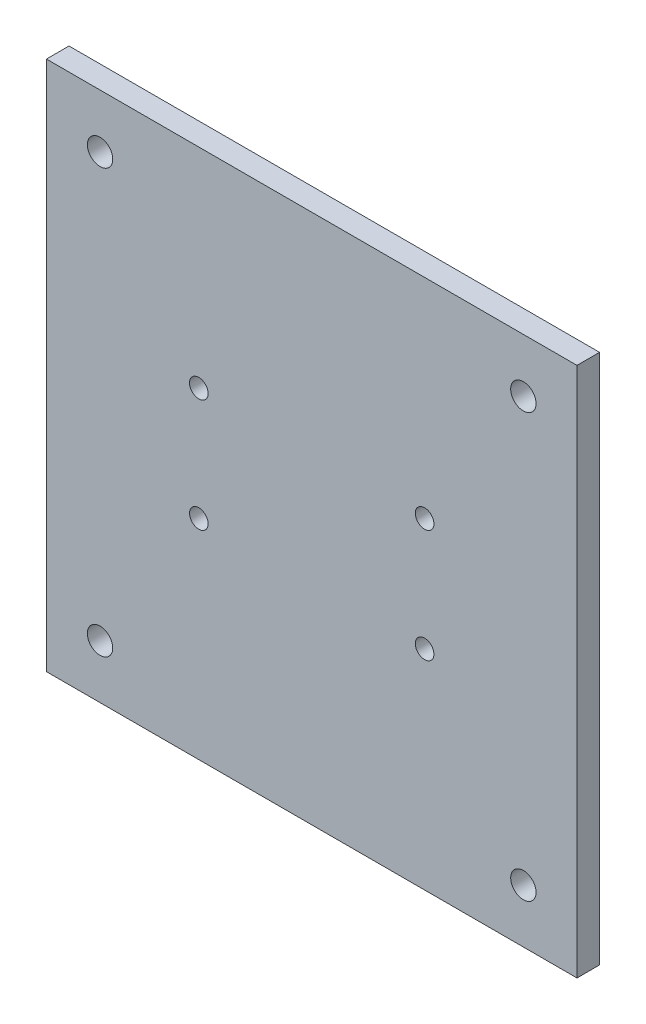
ISO-10303-21;
HEADER;
FILE_DESCRIPTION(('STEP AP214'),'2;1');
FILE_NAME('part.step','',(''),(''),'','','');
FILE_SCHEMA(('AUTOMOTIVE_DESIGN { 1 0 10303 214 1 1 1 1 }'));
ENDSEC;
DATA;
#1=APPLICATION_CONTEXT('core data for automotive mechanical design processes');
#2=APPLICATION_PROTOCOL_DEFINITION('international standard','automotive_design',2000,#1);
#3=PRODUCT_CONTEXT('',#1,'mechanical');
#4=PRODUCT('Part','Part','',(#3));
#5=PRODUCT_RELATED_PRODUCT_CATEGORY('part','',(#4));
#6=PRODUCT_DEFINITION_FORMATION('','',#4);
#7=PRODUCT_DEFINITION_CONTEXT('part definition',#1,'design');
#8=PRODUCT_DEFINITION('design','',#6,#7);
#9=PRODUCT_DEFINITION_SHAPE('','',#8);
#10=(LENGTH_UNIT() NAMED_UNIT(*) SI_UNIT(.MILLI.,.METRE.));
#11=(NAMED_UNIT(*) PLANE_ANGLE_UNIT() SI_UNIT($,.RADIAN.));
#12=(NAMED_UNIT(*) SI_UNIT($,.STERADIAN.) SOLID_ANGLE_UNIT());
#13=UNCERTAINTY_MEASURE_WITH_UNIT(LENGTH_MEASURE(1.E-05),#10,'distance_accuracy_value','');
#14=(GEOMETRIC_REPRESENTATION_CONTEXT(3) GLOBAL_UNCERTAINTY_ASSIGNED_CONTEXT((#13)) GLOBAL_UNIT_ASSIGNED_CONTEXT((#10,
#11,#12)) REPRESENTATION_CONTEXT('',''));
#15=CARTESIAN_POINT('',(0.,0.,0.));
#16=DIRECTION('',(0.,0.,1.));
#17=DIRECTION('',(1.,0.,0.));
#18=AXIS2_PLACEMENT_3D('',#15,#16,#17);
#19=CARTESIAN_POINT('',(-7.99999999999998,69.5000000000001,4.));
#20=DIRECTION('',(1.,0.,0.));
#21=DIRECTION('',(0.,0.,-1.));
#22=AXIS2_PLACEMENT_3D('',#19,#20,#21);
#23=PLANE('',#22);
#24=DIRECTION('',(0.,-1.,0.));
#25=VECTOR('',#24,1.);
#26=CARTESIAN_POINT('',(-7.99999999999998,69.5000000000001,0.));
#27=LINE('',#26,#25);
#28=CARTESIAN_POINT('',(-7.99999999999998,69.5000000000001,0.));
#29=VERTEX_POINT('',#28);
#30=CARTESIAN_POINT('',(-7.99999999999998,-24.5,0.));
#31=VERTEX_POINT('',#30);
#32=EDGE_CURVE('E108',#29,#31,#27,.T.);
#33=ORIENTED_EDGE('',*,*,#32,.T.);
#34=DIRECTION('',(0.,0.,-1.));
#35=VECTOR('',#34,1.);
#36=CARTESIAN_POINT('',(-7.99999999999998,-24.5,4.));
#37=LINE('',#36,#35);
#38=CARTESIAN_POINT('',(-7.99999999999998,-24.5,4.));
#39=VERTEX_POINT('',#38);
#40=EDGE_CURVE('E99',#39,#31,#37,.T.);
#41=ORIENTED_EDGE('',*,*,#40,.F.);
#42=DIRECTION('',(0.,-1.,0.));
#43=VECTOR('',#42,1.);
#44=CARTESIAN_POINT('',(-7.99999999999998,69.5000000000001,4.));
#45=LINE('',#44,#43);
#46=CARTESIAN_POINT('',(-7.99999999999998,69.5000000000001,4.));
#47=VERTEX_POINT('',#46);
#48=EDGE_CURVE('E93',#47,#39,#45,.T.);
#49=ORIENTED_EDGE('',*,*,#48,.F.);
#50=DIRECTION('',(0.,0.,-1.));
#51=VECTOR('',#50,1.);
#52=CARTESIAN_POINT('',(-7.99999999999998,69.5000000000001,4.));
#53=LINE('',#52,#51);
#54=EDGE_CURVE('E104',#47,#29,#53,.T.);
#55=ORIENTED_EDGE('',*,*,#54,.T.);
#56=EDGE_LOOP('',(#33,#41,#49,#55));
#57=FACE_BOUND('',#56,.T.);
#58=ADVANCED_FACE('F38',(#57),#23,.F.);
#59=CARTESIAN_POINT('',(-7.99999999999998,-24.5,4.));
#60=DIRECTION('',(0.,1.,0.));
#61=DIRECTION('',(0.,0.,1.));
#62=AXIS2_PLACEMENT_3D('',#59,#60,#61);
#63=PLANE('',#62);
#64=DIRECTION('',(1.,0.,0.));
#65=VECTOR('',#64,1.);
#66=CARTESIAN_POINT('',(-7.99999999999998,-24.5,0.));
#67=LINE('',#66,#65);
#68=CARTESIAN_POINT('',(86.,-24.5,0.));
#69=VERTEX_POINT('',#68);
#70=EDGE_CURVE('E98',#31,#69,#67,.T.);
#71=ORIENTED_EDGE('',*,*,#70,.T.);
#72=DIRECTION('',(0.,0.,-1.));
#73=VECTOR('',#72,1.);
#74=CARTESIAN_POINT('',(86.,-24.5,4.));
#75=LINE('',#74,#73);
#76=CARTESIAN_POINT('',(86.,-24.5,4.));
#77=VERTEX_POINT('',#76);
#78=EDGE_CURVE('E96',#77,#69,#75,.T.);
#79=ORIENTED_EDGE('',*,*,#78,.F.);
#80=DIRECTION('',(1.,0.,0.));
#81=VECTOR('',#80,1.);
#82=CARTESIAN_POINT('',(-7.99999999999998,-24.5,4.));
#83=LINE('',#82,#81);
#84=EDGE_CURVE('E87',#39,#77,#83,.T.);
#85=ORIENTED_EDGE('',*,*,#84,.F.);
#86=ORIENTED_EDGE('',*,*,#40,.T.);
#87=EDGE_LOOP('',(#71,#79,#85,#86));
#88=FACE_BOUND('',#87,.T.);
#89=ADVANCED_FACE('F97',(#88),#63,.F.);
#90=CARTESIAN_POINT('',(86.,69.5000000000001,4.));
#91=DIRECTION('',(-1.,0.,0.));
#92=DIRECTION('',(0.,0.,1.));
#93=AXIS2_PLACEMENT_3D('',#90,#91,#92);
#94=PLANE('',#93);
#95=DIRECTION('',(0.,1.,0.));
#96=VECTOR('',#95,1.);
#97=CARTESIAN_POINT('',(86.,69.5000000000001,0.));
#98=LINE('',#97,#96);
#99=CARTESIAN_POINT('',(86.,69.5000000000001,0.));
#100=VERTEX_POINT('',#99);
#101=EDGE_CURVE('E73',#69,#100,#98,.T.);
#102=ORIENTED_EDGE('',*,*,#101,.T.);
#103=DIRECTION('',(0.,0.,-1.));
#104=VECTOR('',#103,1.);
#105=CARTESIAN_POINT('',(86.,69.5000000000001,4.));
#106=LINE('',#105,#104);
#107=CARTESIAN_POINT('',(86.,69.5000000000001,4.));
#108=VERTEX_POINT('',#107);
#109=EDGE_CURVE('E100',#108,#100,#106,.T.);
#110=ORIENTED_EDGE('',*,*,#109,.F.);
#111=DIRECTION('',(0.,1.,0.));
#112=VECTOR('',#111,1.);
#113=CARTESIAN_POINT('',(86.,69.5000000000001,4.));
#114=LINE('',#113,#112);
#115=EDGE_CURVE('E91',#77,#108,#114,.T.);
#116=ORIENTED_EDGE('',*,*,#115,.F.);
#117=ORIENTED_EDGE('',*,*,#78,.T.);
#118=EDGE_LOOP('',(#102,#110,#116,#117));
#119=FACE_BOUND('',#118,.T.);
#120=ADVANCED_FACE('F102',(#119),#94,.F.);
#121=CARTESIAN_POINT('',(-7.99999999999998,69.5000000000001,4.));
#122=DIRECTION('',(0.,-1.,0.));
#123=DIRECTION('',(0.,0.,-1.));
#124=AXIS2_PLACEMENT_3D('',#121,#122,#123);
#125=PLANE('',#124);
#126=DIRECTION('',(-1.,0.,0.));
#127=VECTOR('',#126,1.);
#128=CARTESIAN_POINT('',(-7.99999999999998,69.5000000000001,0.));
#129=LINE('',#128,#127);
#130=EDGE_CURVE('E79',#100,#29,#129,.T.);
#131=ORIENTED_EDGE('',*,*,#130,.T.);
#132=ORIENTED_EDGE('',*,*,#54,.F.);
#133=DIRECTION('',(-1.,0.,0.));
#134=VECTOR('',#133,1.);
#135=CARTESIAN_POINT('',(-7.99999999999998,69.5000000000001,4.));
#136=LINE('',#135,#134);
#137=EDGE_CURVE('E56',#108,#47,#136,.T.);
#138=ORIENTED_EDGE('',*,*,#137,.F.);
#139=ORIENTED_EDGE('',*,*,#109,.T.);
#140=EDGE_LOOP('',(#131,#132,#138,#139));
#141=FACE_BOUND('',#140,.T.);
#142=ADVANCED_FACE('F238',(#141),#125,.F.);
#143=CARTESIAN_POINT('',(1.50000000000004,60.,4.));
#144=DIRECTION('',(0.,0.,-1.));
#145=DIRECTION('',(-1.,0.,0.));
#146=AXIS2_PLACEMENT_3D('',#143,#144,#145);
#147=CYLINDRICAL_SURFACE('',#146,2.25);
#148=CARTESIAN_POINT('',(1.50000000000004,60.,4.));
#149=DIRECTION('',(0.,0.,1.));
#150=DIRECTION('',(1.,0.,0.));
#151=AXIS2_PLACEMENT_3D('',#148,#149,#150);
#152=CIRCLE('',#151,2.25);
#153=CARTESIAN_POINT('',(3.75000000000004,60.,4.));
#154=VERTEX_POINT('',#153);
#155=EDGE_CURVE('E111',#154,#154,#152,.T.);
#156=ORIENTED_EDGE('',*,*,#155,.T.);
#157=EDGE_LOOP('',(#156));
#158=FACE_BOUND('',#157,.T.);
#159=CARTESIAN_POINT('',(1.50000000000004,60.,0.));
#160=DIRECTION('',(0.,0.,1.));
#161=DIRECTION('',(1.,0.,0.));
#162=AXIS2_PLACEMENT_3D('',#159,#160,#161);
#163=CIRCLE('',#162,2.25);
#164=CARTESIAN_POINT('',(3.75000000000004,60.,0.));
#165=VERTEX_POINT('',#164);
#166=EDGE_CURVE('E225',#165,#165,#163,.T.);
#167=ORIENTED_EDGE('',*,*,#166,.F.);
#168=EDGE_LOOP('',(#167));
#169=FACE_BOUND('',#168,.T.);
#170=ADVANCED_FACE('F235',(#158,#169),#147,.F.);
#171=CARTESIAN_POINT('',(76.5,60.,4.));
#172=DIRECTION('',(0.,0.,-1.));
#173=DIRECTION('',(-1.,0.,0.));
#174=AXIS2_PLACEMENT_3D('',#171,#172,#173);
#175=CYLINDRICAL_SURFACE('',#174,2.25);
#176=CARTESIAN_POINT('',(76.5,60.,4.));
#177=DIRECTION('',(0.,0.,1.));
#178=DIRECTION('',(1.,0.,0.));
#179=AXIS2_PLACEMENT_3D('',#176,#177,#178);
#180=CIRCLE('',#179,2.25);
#181=CARTESIAN_POINT('',(78.75,60.,4.));
#182=VERTEX_POINT('',#181);
#183=EDGE_CURVE('E222',#182,#182,#180,.T.);
#184=ORIENTED_EDGE('',*,*,#183,.T.);
#185=EDGE_LOOP('',(#184));
#186=FACE_BOUND('',#185,.T.);
#187=CARTESIAN_POINT('',(76.5,60.,0.));
#188=DIRECTION('',(0.,0.,1.));
#189=DIRECTION('',(1.,0.,0.));
#190=AXIS2_PLACEMENT_3D('',#187,#188,#189);
#191=CIRCLE('',#190,2.25);
#192=CARTESIAN_POINT('',(78.75,60.,0.));
#193=VERTEX_POINT('',#192);
#194=EDGE_CURVE('E219',#193,#193,#191,.T.);
#195=ORIENTED_EDGE('',*,*,#194,.F.);
#196=EDGE_LOOP('',(#195));
#197=FACE_BOUND('',#196,.T.);
#198=ADVANCED_FACE('F237',(#186,#197),#175,.F.);
#199=CARTESIAN_POINT('',(76.5,-15.,4.));
#200=DIRECTION('',(0.,0.,-1.));
#201=DIRECTION('',(-1.,0.,0.));
#202=AXIS2_PLACEMENT_3D('',#199,#200,#201);
#203=CYLINDRICAL_SURFACE('',#202,2.25);
#204=CARTESIAN_POINT('',(76.5,-15.,4.));
#205=DIRECTION('',(0.,0.,1.));
#206=DIRECTION('',(1.,0.,0.));
#207=AXIS2_PLACEMENT_3D('',#204,#205,#206);
#208=CIRCLE('',#207,2.25);
#209=CARTESIAN_POINT('',(78.75,-15.,4.));
#210=VERTEX_POINT('',#209);
#211=EDGE_CURVE('E216',#210,#210,#208,.T.);
#212=ORIENTED_EDGE('',*,*,#211,.T.);
#213=EDGE_LOOP('',(#212));
#214=FACE_BOUND('',#213,.T.);
#215=CARTESIAN_POINT('',(76.5,-15.,0.));
#216=DIRECTION('',(0.,0.,1.));
#217=DIRECTION('',(1.,0.,0.));
#218=AXIS2_PLACEMENT_3D('',#215,#216,#217);
#219=CIRCLE('',#218,2.25);
#220=CARTESIAN_POINT('',(78.75,-15.,0.));
#221=VERTEX_POINT('',#220);
#222=EDGE_CURVE('E213',#221,#221,#219,.T.);
#223=ORIENTED_EDGE('',*,*,#222,.F.);
#224=EDGE_LOOP('',(#223));
#225=FACE_BOUND('',#224,.T.);
#226=ADVANCED_FACE('F245',(#214,#225),#203,.F.);
#227=CARTESIAN_POINT('',(1.50000000000004,-15.,4.));
#228=DIRECTION('',(0.,0.,-1.));
#229=DIRECTION('',(-1.,0.,0.));
#230=AXIS2_PLACEMENT_3D('',#227,#228,#229);
#231=CYLINDRICAL_SURFACE('',#230,2.25);
#232=CARTESIAN_POINT('',(1.50000000000004,-15.,4.));
#233=DIRECTION('',(0.,0.,1.));
#234=DIRECTION('',(1.,0.,0.));
#235=AXIS2_PLACEMENT_3D('',#232,#233,#234);
#236=CIRCLE('',#235,2.25);
#237=CARTESIAN_POINT('',(3.75000000000004,-15.,4.));
#238=VERTEX_POINT('',#237);
#239=EDGE_CURVE('E210',#238,#238,#236,.T.);
#240=ORIENTED_EDGE('',*,*,#239,.T.);
#241=EDGE_LOOP('',(#240));
#242=FACE_BOUND('',#241,.T.);
#243=CARTESIAN_POINT('',(1.50000000000004,-15.,0.));
#244=DIRECTION('',(0.,0.,1.));
#245=DIRECTION('',(1.,0.,0.));
#246=AXIS2_PLACEMENT_3D('',#243,#244,#245);
#247=CIRCLE('',#246,2.25);
#248=CARTESIAN_POINT('',(3.75000000000004,-15.,0.));
#249=VERTEX_POINT('',#248);
#250=EDGE_CURVE('E209',#249,#249,#247,.T.);
#251=ORIENTED_EDGE('',*,*,#250,.F.);
#252=EDGE_LOOP('',(#251));
#253=FACE_BOUND('',#252,.T.);
#254=ADVANCED_FACE('F171',(#242,#253),#231,.F.);
#255=CARTESIAN_POINT('',(0.,0.,0.));
#256=DIRECTION('',(0.,0.,-1.));
#257=DIRECTION('',(-1.,0.,0.));
#258=AXIS2_PLACEMENT_3D('',#255,#256,#257);
#259=PLANE('',#258);
#260=CARTESIAN_POINT('',(19.,32.5,0.));
#261=DIRECTION('',(0.,0.,-1.));
#262=DIRECTION('',(-1.,0.,0.));
#263=AXIS2_PLACEMENT_3D('',#260,#261,#262);
#264=CIRCLE('',#263,3.25000000000002);
#265=CARTESIAN_POINT('',(15.75,32.5,0.));
#266=VERTEX_POINT('',#265);
#267=EDGE_CURVE('E130',#266,#266,#264,.F.);
#268=ORIENTED_EDGE('',*,*,#267,.T.);
#269=EDGE_LOOP('',(#268));
#270=FACE_BOUND('',#269,.T.);
#271=CARTESIAN_POINT('',(19.,12.5,0.));
#272=DIRECTION('',(0.,0.,-1.));
#273=DIRECTION('',(-1.,0.,0.));
#274=AXIS2_PLACEMENT_3D('',#271,#272,#273);
#275=CIRCLE('',#274,3.25000000000002);
#276=CARTESIAN_POINT('',(15.75,12.5,0.));
#277=VERTEX_POINT('',#276);
#278=EDGE_CURVE('E127',#277,#277,#275,.F.);
#279=ORIENTED_EDGE('',*,*,#278,.T.);
#280=EDGE_LOOP('',(#279));
#281=FACE_BOUND('',#280,.T.);
#282=CARTESIAN_POINT('',(59.,12.5,0.));
#283=DIRECTION('',(0.,0.,-1.));
#284=DIRECTION('',(-1.,0.,0.));
#285=AXIS2_PLACEMENT_3D('',#282,#283,#284);
#286=CIRCLE('',#285,3.24999999999999);
#287=CARTESIAN_POINT('',(55.75,12.5,0.));
#288=VERTEX_POINT('',#287);
#289=EDGE_CURVE('E124',#288,#288,#286,.F.);
#290=ORIENTED_EDGE('',*,*,#289,.T.);
#291=EDGE_LOOP('',(#290));
#292=FACE_BOUND('',#291,.T.);
#293=CARTESIAN_POINT('',(59.,32.5,0.));
#294=DIRECTION('',(0.,0.,-1.));
#295=DIRECTION('',(-1.,0.,0.));
#296=AXIS2_PLACEMENT_3D('',#293,#294,#295);
#297=CIRCLE('',#296,3.25000000000002);
#298=CARTESIAN_POINT('',(55.75,32.5,0.));
#299=VERTEX_POINT('',#298);
#300=EDGE_CURVE('E121',#299,#299,#297,.F.);
#301=ORIENTED_EDGE('',*,*,#300,.T.);
#302=EDGE_LOOP('',(#301));
#303=FACE_BOUND('',#302,.T.);
#304=ORIENTED_EDGE('',*,*,#32,.F.);
#305=ORIENTED_EDGE('',*,*,#130,.F.);
#306=ORIENTED_EDGE('',*,*,#101,.F.);
#307=ORIENTED_EDGE('',*,*,#70,.F.);
#308=EDGE_LOOP('',(#304,#305,#306,#307));
#309=FACE_BOUND('',#308,.T.);
#310=ORIENTED_EDGE('',*,*,#166,.T.);
#311=EDGE_LOOP('',(#310));
#312=FACE_BOUND('',#311,.T.);
#313=ORIENTED_EDGE('',*,*,#194,.T.);
#314=EDGE_LOOP('',(#313));
#315=FACE_BOUND('',#314,.T.);
#316=ORIENTED_EDGE('',*,*,#222,.T.);
#317=EDGE_LOOP('',(#316));
#318=FACE_BOUND('',#317,.T.);
#319=ORIENTED_EDGE('',*,*,#250,.T.);
#320=EDGE_LOOP('',(#319));
#321=FACE_BOUND('',#320,.T.);
#322=ADVANCED_FACE('F167',(#270,#281,#292,#303,#309,#312,#315,#318,#321),#259,.T.);
#323=CARTESIAN_POINT('',(0.,0.,4.));
#324=DIRECTION('',(0.,0.,-1.));
#325=DIRECTION('',(-1.,0.,0.));
#326=AXIS2_PLACEMENT_3D('',#323,#324,#325);
#327=PLANE('',#326);
#328=CARTESIAN_POINT('',(19.,32.5,4.));
#329=DIRECTION('',(0.,0.,-1.));
#330=DIRECTION('',(1.,0.,0.));
#331=AXIS2_PLACEMENT_3D('',#328,#329,#330);
#332=CIRCLE('',#331,1.65);
#333=CARTESIAN_POINT('',(20.65,32.5,4.));
#334=VERTEX_POINT('',#333);
#335=EDGE_CURVE('E198',#334,#334,#332,.T.);
#336=ORIENTED_EDGE('',*,*,#335,.T.);
#337=EDGE_LOOP('',(#336));
#338=FACE_BOUND('',#337,.T.);
#339=CARTESIAN_POINT('',(19.,12.5,4.));
#340=DIRECTION('',(0.,0.,-1.));
#341=DIRECTION('',(-1.,0.,0.));
#342=AXIS2_PLACEMENT_3D('',#339,#340,#341);
#343=CIRCLE('',#342,1.65);
#344=CARTESIAN_POINT('',(17.35,12.5,4.));
#345=VERTEX_POINT('',#344);
#346=EDGE_CURVE('E199',#345,#345,#343,.T.);
#347=ORIENTED_EDGE('',*,*,#346,.T.);
#348=EDGE_LOOP('',(#347));
#349=FACE_BOUND('',#348,.T.);
#350=CARTESIAN_POINT('',(59.,12.5,4.));
#351=DIRECTION('',(0.,0.,-1.));
#352=DIRECTION('',(1.,0.,0.));
#353=AXIS2_PLACEMENT_3D('',#350,#351,#352);
#354=CIRCLE('',#353,1.65);
#355=CARTESIAN_POINT('',(60.65,12.5,4.));
#356=VERTEX_POINT('',#355);
#357=EDGE_CURVE('E202',#356,#356,#354,.T.);
#358=ORIENTED_EDGE('',*,*,#357,.T.);
#359=EDGE_LOOP('',(#358));
#360=FACE_BOUND('',#359,.T.);
#361=CARTESIAN_POINT('',(59.,32.5,4.));
#362=DIRECTION('',(0.,0.,-1.));
#363=DIRECTION('',(-1.,0.,0.));
#364=AXIS2_PLACEMENT_3D('',#361,#362,#363);
#365=CIRCLE('',#364,1.65);
#366=CARTESIAN_POINT('',(57.35,32.5,4.));
#367=VERTEX_POINT('',#366);
#368=EDGE_CURVE('E206',#367,#367,#365,.T.);
#369=ORIENTED_EDGE('',*,*,#368,.T.);
#370=EDGE_LOOP('',(#369));
#371=FACE_BOUND('',#370,.T.);
#372=ORIENTED_EDGE('',*,*,#211,.F.);
#373=EDGE_LOOP('',(#372));
#374=FACE_BOUND('',#373,.T.);
#375=ORIENTED_EDGE('',*,*,#155,.F.);
#376=EDGE_LOOP('',(#375));
#377=FACE_BOUND('',#376,.T.);
#378=ORIENTED_EDGE('',*,*,#48,.T.);
#379=ORIENTED_EDGE('',*,*,#84,.T.);
#380=ORIENTED_EDGE('',*,*,#115,.T.);
#381=ORIENTED_EDGE('',*,*,#137,.T.);
#382=EDGE_LOOP('',(#378,#379,#380,#381));
#383=FACE_BOUND('',#382,.T.);
#384=ORIENTED_EDGE('',*,*,#183,.F.);
#385=EDGE_LOOP('',(#384));
#386=FACE_BOUND('',#385,.T.);
#387=ORIENTED_EDGE('',*,*,#239,.F.);
#388=EDGE_LOOP('',(#387));
#389=FACE_BOUND('',#388,.T.);
#390=ADVANCED_FACE('F88',(#338,#349,#360,#371,#374,#377,#383,#386,#389),#327,.F.);
#391=CARTESIAN_POINT('',(59.,32.5,4.));
#392=DIRECTION('',(0.,0.,-1.));
#393=DIRECTION('',(-1.,0.,0.));
#394=AXIS2_PLACEMENT_3D('',#391,#392,#393);
#395=CYLINDRICAL_SURFACE('',#394,1.65);
#396=CARTESIAN_POINT('',(59.,32.5,1.60000000000001));
#397=DIRECTION('',(0.,0.,-1.));
#398=DIRECTION('',(-1.,0.,0.));
#399=AXIS2_PLACEMENT_3D('',#396,#397,#398);
#400=CIRCLE('',#399,1.65);
#401=CARTESIAN_POINT('',(57.35,32.5,1.60000000000001));
#402=VERTEX_POINT('',#401);
#403=EDGE_CURVE('E11',#402,#402,#400,.T.);
#404=ORIENTED_EDGE('',*,*,#403,.T.);
#405=EDGE_LOOP('',(#404));
#406=FACE_BOUND('',#405,.T.);
#407=ORIENTED_EDGE('',*,*,#368,.F.);
#408=EDGE_LOOP('',(#407));
#409=FACE_BOUND('',#408,.T.);
#410=ADVANCED_FACE('F166',(#406,#409),#395,.F.);
#411=CARTESIAN_POINT('',(59.,12.5,4.));
#412=DIRECTION('',(0.,0.,-1.));
#413=DIRECTION('',(-1.,0.,0.));
#414=AXIS2_PLACEMENT_3D('',#411,#412,#413);
#415=CYLINDRICAL_SURFACE('',#414,1.65);
#416=CARTESIAN_POINT('',(59.,12.5,1.59999999999997));
#417=DIRECTION('',(0.,0.,-1.));
#418=DIRECTION('',(-1.,0.,0.));
#419=AXIS2_PLACEMENT_3D('',#416,#417,#418);
#420=CIRCLE('',#419,1.65);
#421=CARTESIAN_POINT('',(57.35,12.5,1.59999999999997));
#422=VERTEX_POINT('',#421);
#423=EDGE_CURVE('E48',#422,#422,#420,.T.);
#424=ORIENTED_EDGE('',*,*,#423,.T.);
#425=EDGE_LOOP('',(#424));
#426=FACE_BOUND('',#425,.T.);
#427=ORIENTED_EDGE('',*,*,#357,.F.);
#428=EDGE_LOOP('',(#427));
#429=FACE_BOUND('',#428,.T.);
#430=ADVANCED_FACE('F138',(#426,#429),#415,.F.);
#431=CARTESIAN_POINT('',(19.,12.5,4.));
#432=DIRECTION('',(0.,0.,-1.));
#433=DIRECTION('',(-1.,0.,0.));
#434=AXIS2_PLACEMENT_3D('',#431,#432,#433);
#435=CYLINDRICAL_SURFACE('',#434,1.65);
#436=CARTESIAN_POINT('',(19.,12.5,1.60000000000001));
#437=DIRECTION('',(0.,0.,-1.));
#438=DIRECTION('',(-1.,0.,0.));
#439=AXIS2_PLACEMENT_3D('',#436,#437,#438);
#440=CIRCLE('',#439,1.65);
#441=CARTESIAN_POINT('',(17.35,12.5,1.60000000000001));
#442=VERTEX_POINT('',#441);
#443=EDGE_CURVE('E133',#442,#442,#440,.T.);
#444=ORIENTED_EDGE('',*,*,#443,.T.);
#445=EDGE_LOOP('',(#444));
#446=FACE_BOUND('',#445,.T.);
#447=ORIENTED_EDGE('',*,*,#346,.F.);
#448=EDGE_LOOP('',(#447));
#449=FACE_BOUND('',#448,.T.);
#450=ADVANCED_FACE('F189',(#446,#449),#435,.F.);
#451=CARTESIAN_POINT('',(19.,32.5,4.));
#452=DIRECTION('',(0.,0.,-1.));
#453=DIRECTION('',(-1.,0.,0.));
#454=AXIS2_PLACEMENT_3D('',#451,#452,#453);
#455=CYLINDRICAL_SURFACE('',#454,1.65);
#456=CARTESIAN_POINT('',(19.,32.5,1.60000000000001));
#457=DIRECTION('',(0.,0.,-1.));
#458=DIRECTION('',(-1.,0.,0.));
#459=AXIS2_PLACEMENT_3D('',#456,#457,#458);
#460=CIRCLE('',#459,1.65);
#461=CARTESIAN_POINT('',(17.35,32.5,1.60000000000001));
#462=VERTEX_POINT('',#461);
#463=EDGE_CURVE('E118',#462,#462,#460,.T.);
#464=ORIENTED_EDGE('',*,*,#463,.T.);
#465=EDGE_LOOP('',(#464));
#466=FACE_BOUND('',#465,.T.);
#467=ORIENTED_EDGE('',*,*,#335,.F.);
#468=EDGE_LOOP('',(#467));
#469=FACE_BOUND('',#468,.T.);
#470=ADVANCED_FACE('F178',(#466,#469),#455,.F.);
#471=CARTESIAN_POINT('',(19.,32.5,1.60000000000001));
#472=DIRECTION('',(0.,0.,-1.));
#473=DIRECTION('',(-1.,0.,0.));
#474=AXIS2_PLACEMENT_3D('',#471,#472,#473);
#475=CONICAL_SURFACE('',#474,1.65,0.785398163397451);
#476=ORIENTED_EDGE('',*,*,#267,.F.);
#477=EDGE_LOOP('',(#476));
#478=FACE_BOUND('',#477,.T.);
#479=ORIENTED_EDGE('',*,*,#463,.F.);
#480=EDGE_LOOP('',(#479));
#481=FACE_BOUND('',#480,.T.);
#482=ADVANCED_FACE('F150',(#478,#481),#475,.F.);
#483=CARTESIAN_POINT('',(19.,12.5,1.60000000000001));
#484=DIRECTION('',(0.,0.,-1.));
#485=DIRECTION('',(-1.,0.,0.));
#486=AXIS2_PLACEMENT_3D('',#483,#484,#485);
#487=CONICAL_SURFACE('',#486,1.65,0.785398163397451);
#488=ORIENTED_EDGE('',*,*,#278,.F.);
#489=EDGE_LOOP('',(#488));
#490=FACE_BOUND('',#489,.T.);
#491=ORIENTED_EDGE('',*,*,#443,.F.);
#492=EDGE_LOOP('',(#491));
#493=FACE_BOUND('',#492,.T.);
#494=ADVANCED_FACE('F143',(#490,#493),#487,.F.);
#495=CARTESIAN_POINT('',(59.,12.5,1.59999999999997));
#496=DIRECTION('',(0.,0.,-1.));
#497=DIRECTION('',(-1.,0.,0.));
#498=AXIS2_PLACEMENT_3D('',#495,#496,#497);
#499=CONICAL_SURFACE('',#498,1.65,0.785398163397455);
#500=ORIENTED_EDGE('',*,*,#289,.F.);
#501=EDGE_LOOP('',(#500));
#502=FACE_BOUND('',#501,.T.);
#503=ORIENTED_EDGE('',*,*,#423,.F.);
#504=EDGE_LOOP('',(#503));
#505=FACE_BOUND('',#504,.T.);
#506=ADVANCED_FACE('F141',(#502,#505),#499,.F.);
#507=CARTESIAN_POINT('',(59.,32.5,1.60000000000001));
#508=DIRECTION('',(0.,0.,-1.));
#509=DIRECTION('',(-1.,0.,0.));
#510=AXIS2_PLACEMENT_3D('',#507,#508,#509);
#511=CONICAL_SURFACE('',#510,1.65,0.785398163397451);
#512=ORIENTED_EDGE('',*,*,#300,.F.);
#513=EDGE_LOOP('',(#512));
#514=FACE_BOUND('',#513,.T.);
#515=ORIENTED_EDGE('',*,*,#403,.F.);
#516=EDGE_LOOP('',(#515));
#517=FACE_BOUND('',#516,.T.);
#518=ADVANCED_FACE('F41',(#514,#517),#511,.F.);
#519=CLOSED_SHELL('',(#58,#89,#120,#142,#170,#198,#226,#254,#322,#390,#410,#430,#450,#470,#482,
#494,#506,#518));
#520=MANIFOLD_SOLID_BREP('B2',#519);
#521=ADVANCED_BREP_SHAPE_REPRESENTATION('',(#18,#520),#14);
#522=SHAPE_DEFINITION_REPRESENTATION(#9,#521);
ENDSEC;
END-ISO-10303-21;
